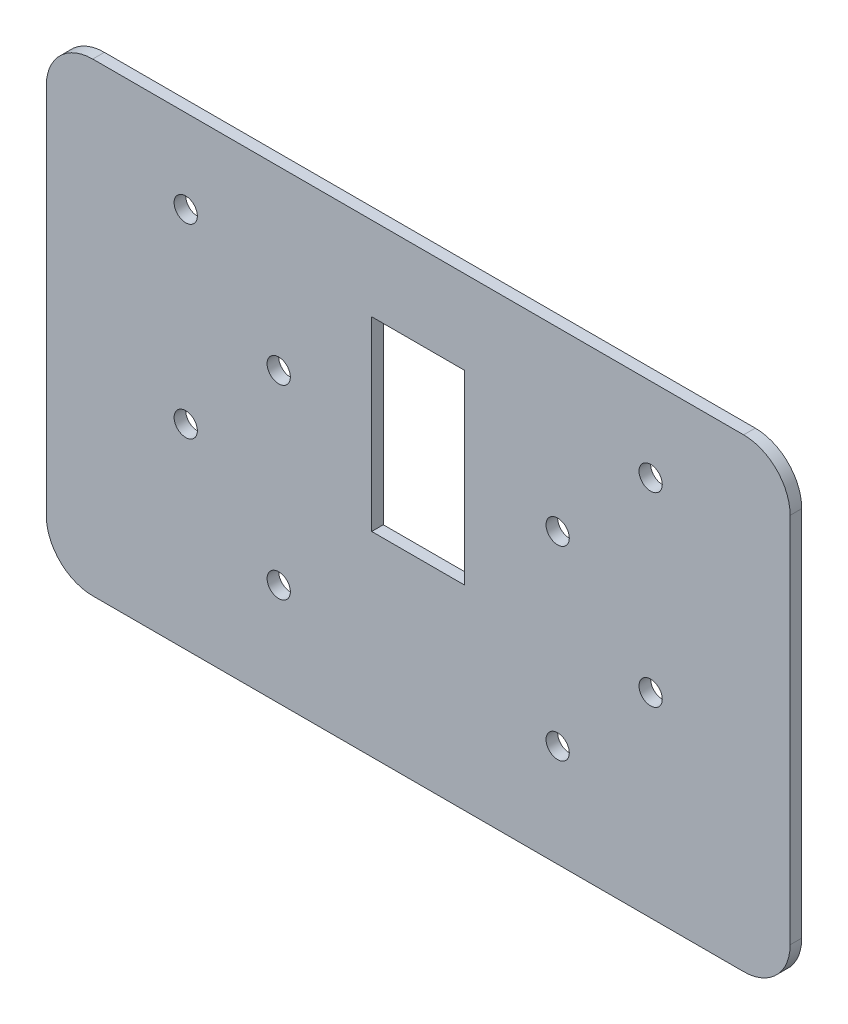
ISO-10303-21;
HEADER;
FILE_DESCRIPTION(('STEP AP214'),'2;1');
FILE_NAME('part.step','',(''),(''),'','','');
FILE_SCHEMA(('AUTOMOTIVE_DESIGN { 1 0 10303 214 1 1 1 1 }'));
ENDSEC;
DATA;
#1=APPLICATION_CONTEXT('core data for automotive mechanical design processes');
#2=APPLICATION_PROTOCOL_DEFINITION('international standard','automotive_design',2000,#1);
#3=PRODUCT_CONTEXT('',#1,'mechanical');
#4=PRODUCT('Part','Part','',(#3));
#5=PRODUCT_RELATED_PRODUCT_CATEGORY('part','',(#4));
#6=PRODUCT_DEFINITION_FORMATION('','',#4);
#7=PRODUCT_DEFINITION_CONTEXT('part definition',#1,'design');
#8=PRODUCT_DEFINITION('design','',#6,#7);
#9=PRODUCT_DEFINITION_SHAPE('','',#8);
#10=(LENGTH_UNIT() NAMED_UNIT(*) SI_UNIT(.MILLI.,.METRE.));
#11=(NAMED_UNIT(*) PLANE_ANGLE_UNIT() SI_UNIT($,.RADIAN.));
#12=(NAMED_UNIT(*) SI_UNIT($,.STERADIAN.) SOLID_ANGLE_UNIT());
#13=UNCERTAINTY_MEASURE_WITH_UNIT(LENGTH_MEASURE(1.E-05),#10,'distance_accuracy_value','');
#14=(GEOMETRIC_REPRESENTATION_CONTEXT(3) GLOBAL_UNCERTAINTY_ASSIGNED_CONTEXT((#13)) GLOBAL_UNIT_ASSIGNED_CONTEXT((#10,
#11,#12)) REPRESENTATION_CONTEXT('',''));
#15=CARTESIAN_POINT('',(0.,0.,0.));
#16=DIRECTION('',(0.,0.,1.));
#17=DIRECTION('',(1.,0.,0.));
#18=AXIS2_PLACEMENT_3D('',#15,#16,#17);
#19=CARTESIAN_POINT('',(0.,454.630831077748,3.175));
#20=DIRECTION('',(0.,1.,0.));
#21=DIRECTION('',(0.,0.,1.));
#22=AXIS2_PLACEMENT_3D('',#19,#20,#21);
#23=PLANE('',#22);
#24=DIRECTION('',(1.,0.,0.));
#25=VECTOR('',#24,1.);
#26=CARTESIAN_POINT('',(0.,454.630831077748,0.));
#27=LINE('',#26,#25);
#28=CARTESIAN_POINT('',(214.219369125784,454.630831077748,0.));
#29=VERTEX_POINT('',#28);
#30=CARTESIAN_POINT('',(392.019369125783,454.630831077748,0.));
#31=VERTEX_POINT('',#30);
#32=EDGE_CURVE('E197',#29,#31,#27,.T.);
#33=ORIENTED_EDGE('',*,*,#32,.F.);
#34=DIRECTION('',(0.,0.,-1.));
#35=VECTOR('',#34,1.);
#36=CARTESIAN_POINT('',(214.219369125784,454.630831077748,3.175));
#37=LINE('',#36,#35);
#38=CARTESIAN_POINT('',(214.219369125784,454.630831077748,3.175));
#39=VERTEX_POINT('',#38);
#40=EDGE_CURVE('E11',#39,#29,#37,.T.);
#41=ORIENTED_EDGE('',*,*,#40,.F.);
#42=DIRECTION('',(1.,0.,0.));
#43=VECTOR('',#42,1.);
#44=CARTESIAN_POINT('',(0.,454.630831077748,3.175));
#45=LINE('',#44,#43);
#46=CARTESIAN_POINT('',(392.019369125783,454.630831077748,3.175));
#47=VERTEX_POINT('',#46);
#48=EDGE_CURVE('E283',#39,#47,#45,.T.);
#49=ORIENTED_EDGE('',*,*,#48,.T.);
#50=DIRECTION('',(0.,0.,-1.));
#51=VECTOR('',#50,1.);
#52=CARTESIAN_POINT('',(392.019369125783,454.630831077748,3.175));
#53=LINE('',#52,#51);
#54=EDGE_CURVE('E55',#47,#31,#53,.T.);
#55=ORIENTED_EDGE('',*,*,#54,.T.);
#56=EDGE_LOOP('',(#33,#41,#49,#55));
#57=FACE_BOUND('',#56,.T.);
#58=ADVANCED_FACE('F36',(#57),#23,.T.);
#59=CARTESIAN_POINT('',(214.219369125784,441.930831077748,3.175));
#60=DIRECTION('',(0.,0.,-1.));
#61=DIRECTION('',(-1.,0.,0.));
#62=AXIS2_PLACEMENT_3D('',#59,#60,#61);
#63=CYLINDRICAL_SURFACE('',#62,12.7);
#64=CARTESIAN_POINT('',(214.219369125784,441.930831077748,0.));
#65=DIRECTION('',(0.,0.,1.));
#66=DIRECTION('',(1.,0.,0.));
#67=AXIS2_PLACEMENT_3D('',#64,#65,#66);
#68=CIRCLE('',#67,12.7);
#69=CARTESIAN_POINT('',(201.519369125784,441.930831077748,0.));
#70=VERTEX_POINT('',#69);
#71=EDGE_CURVE('E199',#29,#70,#68,.T.);
#72=ORIENTED_EDGE('',*,*,#71,.T.);
#73=DIRECTION('',(0.,0.,-1.));
#74=VECTOR('',#73,1.);
#75=CARTESIAN_POINT('',(201.519369125784,441.930831077748,3.175));
#76=LINE('',#75,#74);
#77=CARTESIAN_POINT('',(201.519369125784,441.930831077748,3.175));
#78=VERTEX_POINT('',#77);
#79=EDGE_CURVE('E46',#78,#70,#76,.T.);
#80=ORIENTED_EDGE('',*,*,#79,.F.);
#81=CARTESIAN_POINT('',(214.219369125784,441.930831077748,3.175));
#82=DIRECTION('',(0.,0.,1.));
#83=DIRECTION('',(1.,0.,0.));
#84=AXIS2_PLACEMENT_3D('',#81,#82,#83);
#85=CIRCLE('',#84,12.7);
#86=EDGE_CURVE('E285',#39,#78,#85,.T.);
#87=ORIENTED_EDGE('',*,*,#86,.F.);
#88=ORIENTED_EDGE('',*,*,#40,.T.);
#89=EDGE_LOOP('',(#72,#80,#87,#88));
#90=FACE_BOUND('',#89,.T.);
#91=ADVANCED_FACE('F318',(#90),#63,.T.);
#92=CARTESIAN_POINT('',(201.519369125784,0.,3.175));
#93=DIRECTION('',(1.,0.,0.));
#94=DIRECTION('',(0.,1.,0.));
#95=AXIS2_PLACEMENT_3D('',#92,#93,#94);
#96=PLANE('',#95);
#97=DIRECTION('',(0.,-1.,0.));
#98=VECTOR('',#97,1.);
#99=CARTESIAN_POINT('',(201.519369125784,0.,0.));
#100=LINE('',#99,#98);
#101=CARTESIAN_POINT('',(201.519369125784,340.330831077748,0.));
#102=VERTEX_POINT('',#101);
#103=EDGE_CURVE('E202',#70,#102,#100,.T.);
#104=ORIENTED_EDGE('',*,*,#103,.T.);
#105=DIRECTION('',(0.,0.,-1.));
#106=VECTOR('',#105,1.);
#107=CARTESIAN_POINT('',(201.519369125784,340.330831077748,3.175));
#108=LINE('',#107,#106);
#109=CARTESIAN_POINT('',(201.519369125784,340.330831077748,3.175));
#110=VERTEX_POINT('',#109);
#111=EDGE_CURVE('E236',#110,#102,#108,.T.);
#112=ORIENTED_EDGE('',*,*,#111,.F.);
#113=DIRECTION('',(0.,-1.,0.));
#114=VECTOR('',#113,1.);
#115=CARTESIAN_POINT('',(201.519369125784,0.,3.175));
#116=LINE('',#115,#114);
#117=EDGE_CURVE('E288',#78,#110,#116,.T.);
#118=ORIENTED_EDGE('',*,*,#117,.F.);
#119=ORIENTED_EDGE('',*,*,#79,.T.);
#120=EDGE_LOOP('',(#104,#112,#118,#119));
#121=FACE_BOUND('',#120,.T.);
#122=ADVANCED_FACE('F323',(#121),#96,.F.);
#123=CARTESIAN_POINT('',(214.219369125784,340.330831077748,3.175));
#124=DIRECTION('',(0.,0.,-1.));
#125=DIRECTION('',(-1.,0.,0.));
#126=AXIS2_PLACEMENT_3D('',#123,#124,#125);
#127=CYLINDRICAL_SURFACE('',#126,12.7);
#128=CARTESIAN_POINT('',(214.219369125784,340.330831077748,0.));
#129=DIRECTION('',(0.,0.,1.));
#130=DIRECTION('',(1.,0.,0.));
#131=AXIS2_PLACEMENT_3D('',#128,#129,#130);
#132=CIRCLE('',#131,12.7);
#133=CARTESIAN_POINT('',(214.219369125784,327.630831077748,0.));
#134=VERTEX_POINT('',#133);
#135=EDGE_CURVE('E205',#102,#134,#132,.T.);
#136=ORIENTED_EDGE('',*,*,#135,.T.);
#137=DIRECTION('',(0.,0.,-1.));
#138=VECTOR('',#137,1.);
#139=CARTESIAN_POINT('',(214.219369125784,327.630831077748,3.175));
#140=LINE('',#139,#138);
#141=CARTESIAN_POINT('',(214.219369125784,327.630831077748,3.175));
#142=VERTEX_POINT('',#141);
#143=EDGE_CURVE('E233',#142,#134,#140,.T.);
#144=ORIENTED_EDGE('',*,*,#143,.F.);
#145=CARTESIAN_POINT('',(214.219369125784,340.330831077748,3.175));
#146=DIRECTION('',(0.,0.,1.));
#147=DIRECTION('',(1.,0.,0.));
#148=AXIS2_PLACEMENT_3D('',#145,#146,#147);
#149=CIRCLE('',#148,12.7);
#150=EDGE_CURVE('E291',#110,#142,#149,.T.);
#151=ORIENTED_EDGE('',*,*,#150,.F.);
#152=ORIENTED_EDGE('',*,*,#111,.T.);
#153=EDGE_LOOP('',(#136,#144,#151,#152));
#154=FACE_BOUND('',#153,.T.);
#155=ADVANCED_FACE('F295',(#154),#127,.T.);
#156=CARTESIAN_POINT('',(0.,327.630831077748,3.175));
#157=DIRECTION('',(0.,1.,0.));
#158=DIRECTION('',(0.,0.,1.));
#159=AXIS2_PLACEMENT_3D('',#156,#157,#158);
#160=PLANE('',#159);
#161=DIRECTION('',(1.,0.,0.));
#162=VECTOR('',#161,1.);
#163=CARTESIAN_POINT('',(0.,327.630831077748,0.));
#164=LINE('',#163,#162);
#165=CARTESIAN_POINT('',(392.019369125783,327.630831077748,0.));
#166=VERTEX_POINT('',#165);
#167=EDGE_CURVE('E208',#134,#166,#164,.T.);
#168=ORIENTED_EDGE('',*,*,#167,.T.);
#169=DIRECTION('',(0.,0.,-1.));
#170=VECTOR('',#169,1.);
#171=CARTESIAN_POINT('',(392.019369125783,327.630831077748,3.175));
#172=LINE('',#171,#170);
#173=CARTESIAN_POINT('',(392.019369125783,327.630831077748,3.175));
#174=VERTEX_POINT('',#173);
#175=EDGE_CURVE('E152',#174,#166,#172,.T.);
#176=ORIENTED_EDGE('',*,*,#175,.F.);
#177=DIRECTION('',(1.,0.,0.));
#178=VECTOR('',#177,1.);
#179=CARTESIAN_POINT('',(0.,327.630831077748,3.175));
#180=LINE('',#179,#178);
#181=EDGE_CURVE('E141',#142,#174,#180,.T.);
#182=ORIENTED_EDGE('',*,*,#181,.F.);
#183=ORIENTED_EDGE('',*,*,#143,.T.);
#184=EDGE_LOOP('',(#168,#176,#182,#183));
#185=FACE_BOUND('',#184,.T.);
#186=ADVANCED_FACE('F297',(#185),#160,.F.);
#187=CARTESIAN_POINT('',(392.019369125784,340.330831077748,3.175));
#188=DIRECTION('',(0.,0.,-1.));
#189=DIRECTION('',(-1.,0.,0.));
#190=AXIS2_PLACEMENT_3D('',#187,#188,#189);
#191=CYLINDRICAL_SURFACE('',#190,12.7);
#192=CARTESIAN_POINT('',(392.019369125784,340.330831077748,0.));
#193=DIRECTION('',(0.,0.,1.));
#194=DIRECTION('',(1.,0.,0.));
#195=AXIS2_PLACEMENT_3D('',#192,#193,#194);
#196=CIRCLE('',#195,12.7);
#197=CARTESIAN_POINT('',(404.719369125784,340.330831077748,0.));
#198=VERTEX_POINT('',#197);
#199=EDGE_CURVE('E149',#166,#198,#196,.T.);
#200=ORIENTED_EDGE('',*,*,#199,.T.);
#201=DIRECTION('',(0.,0.,-1.));
#202=VECTOR('',#201,1.);
#203=CARTESIAN_POINT('',(404.719369125784,340.330831077748,3.175));
#204=LINE('',#203,#202);
#205=CARTESIAN_POINT('',(404.719369125784,340.330831077748,3.175));
#206=VERTEX_POINT('',#205);
#207=EDGE_CURVE('E147',#206,#198,#204,.T.);
#208=ORIENTED_EDGE('',*,*,#207,.F.);
#209=CARTESIAN_POINT('',(392.019369125784,340.330831077748,3.175));
#210=DIRECTION('',(0.,0.,1.));
#211=DIRECTION('',(1.,0.,0.));
#212=AXIS2_PLACEMENT_3D('',#209,#210,#211);
#213=CIRCLE('',#212,12.7);
#214=EDGE_CURVE('E132',#174,#206,#213,.T.);
#215=ORIENTED_EDGE('',*,*,#214,.F.);
#216=ORIENTED_EDGE('',*,*,#175,.T.);
#217=EDGE_LOOP('',(#200,#208,#215,#216));
#218=FACE_BOUND('',#217,.T.);
#219=ADVANCED_FACE('F148',(#218),#191,.T.);
#220=CARTESIAN_POINT('',(404.719369125784,0.,3.175));
#221=DIRECTION('',(1.,0.,0.));
#222=DIRECTION('',(0.,0.,-1.));
#223=AXIS2_PLACEMENT_3D('',#220,#221,#222);
#224=PLANE('',#223);
#225=DIRECTION('',(0.,-1.,0.));
#226=VECTOR('',#225,1.);
#227=CARTESIAN_POINT('',(404.719369125784,0.,0.));
#228=LINE('',#227,#226);
#229=CARTESIAN_POINT('',(404.719369125784,441.930831077748,0.));
#230=VERTEX_POINT('',#229);
#231=EDGE_CURVE('E212',#230,#198,#228,.T.);
#232=ORIENTED_EDGE('',*,*,#231,.F.);
#233=DIRECTION('',(0.,0.,-1.));
#234=VECTOR('',#233,1.);
#235=CARTESIAN_POINT('',(404.719369125784,441.930831077748,3.175));
#236=LINE('',#235,#234);
#237=CARTESIAN_POINT('',(404.719369125784,441.930831077748,3.175));
#238=VERTEX_POINT('',#237);
#239=EDGE_CURVE('E92',#238,#230,#236,.T.);
#240=ORIENTED_EDGE('',*,*,#239,.F.);
#241=DIRECTION('',(0.,-1.,0.));
#242=VECTOR('',#241,1.);
#243=CARTESIAN_POINT('',(404.719369125784,0.,3.175));
#244=LINE('',#243,#242);
#245=EDGE_CURVE('E139',#238,#206,#244,.T.);
#246=ORIENTED_EDGE('',*,*,#245,.T.);
#247=ORIENTED_EDGE('',*,*,#207,.T.);
#248=EDGE_LOOP('',(#232,#240,#246,#247));
#249=FACE_BOUND('',#248,.T.);
#250=ADVANCED_FACE('F154',(#249),#224,.T.);
#251=CARTESIAN_POINT('',(290.419369125784,0.,3.175));
#252=DIRECTION('',(1.,0.,0.));
#253=DIRECTION('',(0.,0.,-1.));
#254=AXIS2_PLACEMENT_3D('',#251,#252,#253);
#255=PLANE('',#254);
#256=DIRECTION('',(0.,-1.,0.));
#257=VECTOR('',#256,1.);
#258=CARTESIAN_POINT('',(290.419369125784,0.,0.));
#259=LINE('',#258,#257);
#260=CARTESIAN_POINT('',(290.419369125784,431.770831077748,0.));
#261=VERTEX_POINT('',#260);
#262=CARTESIAN_POINT('',(290.419369125784,380.970831077748,0.));
#263=VERTEX_POINT('',#262);
#264=EDGE_CURVE('E173',#261,#263,#259,.T.);
#265=ORIENTED_EDGE('',*,*,#264,.F.);
#266=DIRECTION('',(0.,0.,-1.));
#267=VECTOR('',#266,1.);
#268=CARTESIAN_POINT('',(290.419369125784,431.770831077748,3.175));
#269=LINE('',#268,#267);
#270=CARTESIAN_POINT('',(290.419369125784,431.770831077748,3.175));
#271=VERTEX_POINT('',#270);
#272=EDGE_CURVE('E40',#271,#261,#269,.T.);
#273=ORIENTED_EDGE('',*,*,#272,.F.);
#274=DIRECTION('',(0.,-1.,0.));
#275=VECTOR('',#274,1.);
#276=CARTESIAN_POINT('',(290.419369125784,0.,3.175));
#277=LINE('',#276,#275);
#278=CARTESIAN_POINT('',(290.419369125784,380.970831077748,3.175));
#279=VERTEX_POINT('',#278);
#280=EDGE_CURVE('E229',#271,#279,#277,.T.);
#281=ORIENTED_EDGE('',*,*,#280,.T.);
#282=DIRECTION('',(0.,0.,-1.));
#283=VECTOR('',#282,1.);
#284=CARTESIAN_POINT('',(290.419369125784,380.970831077748,3.175));
#285=LINE('',#284,#283);
#286=EDGE_CURVE('E172',#279,#263,#285,.T.);
#287=ORIENTED_EDGE('',*,*,#286,.T.);
#288=EDGE_LOOP('',(#265,#273,#281,#287));
#289=FACE_BOUND('',#288,.T.);
#290=ADVANCED_FACE('F38',(#289),#255,.T.);
#291=CARTESIAN_POINT('',(0.,431.770831077748,3.175));
#292=DIRECTION('',(0.,-1.,0.));
#293=DIRECTION('',(0.,0.,-1.));
#294=AXIS2_PLACEMENT_3D('',#291,#292,#293);
#295=PLANE('',#294);
#296=DIRECTION('',(-1.,0.,0.));
#297=VECTOR('',#296,1.);
#298=CARTESIAN_POINT('',(0.,431.770831077748,0.));
#299=LINE('',#298,#297);
#300=CARTESIAN_POINT('',(315.819369125784,431.770831077748,0.));
#301=VERTEX_POINT('',#300);
#302=EDGE_CURVE('E176',#301,#261,#299,.T.);
#303=ORIENTED_EDGE('',*,*,#302,.F.);
#304=DIRECTION('',(0.,0.,-1.));
#305=VECTOR('',#304,1.);
#306=CARTESIAN_POINT('',(315.819369125784,431.770831077748,3.175));
#307=LINE('',#306,#305);
#308=CARTESIAN_POINT('',(315.819369125784,431.770831077748,3.175));
#309=VERTEX_POINT('',#308);
#310=EDGE_CURVE('E243',#309,#301,#307,.T.);
#311=ORIENTED_EDGE('',*,*,#310,.F.);
#312=DIRECTION('',(-1.,0.,0.));
#313=VECTOR('',#312,1.);
#314=CARTESIAN_POINT('',(0.,431.770831077748,3.175));
#315=LINE('',#314,#313);
#316=EDGE_CURVE('E252',#309,#271,#315,.T.);
#317=ORIENTED_EDGE('',*,*,#316,.T.);
#318=ORIENTED_EDGE('',*,*,#272,.T.);
#319=EDGE_LOOP('',(#303,#311,#317,#318));
#320=FACE_BOUND('',#319,.T.);
#321=ADVANCED_FACE('F250',(#320),#295,.T.);
#322=CARTESIAN_POINT('',(315.819369125784,0.,3.175));
#323=DIRECTION('',(-1.,0.,0.));
#324=DIRECTION('',(0.,0.,1.));
#325=AXIS2_PLACEMENT_3D('',#322,#323,#324);
#326=PLANE('',#325);
#327=DIRECTION('',(0.,1.,0.));
#328=VECTOR('',#327,1.);
#329=CARTESIAN_POINT('',(315.819369125784,0.,0.));
#330=LINE('',#329,#328);
#331=CARTESIAN_POINT('',(315.819369125784,380.970831077748,0.));
#332=VERTEX_POINT('',#331);
#333=EDGE_CURVE('E179',#332,#301,#330,.T.);
#334=ORIENTED_EDGE('',*,*,#333,.F.);
#335=DIRECTION('',(0.,0.,-1.));
#336=VECTOR('',#335,1.);
#337=CARTESIAN_POINT('',(315.819369125784,380.970831077748,3.175));
#338=LINE('',#337,#336);
#339=CARTESIAN_POINT('',(315.819369125784,380.970831077748,3.175));
#340=VERTEX_POINT('',#339);
#341=EDGE_CURVE('E242',#340,#332,#338,.T.);
#342=ORIENTED_EDGE('',*,*,#341,.F.);
#343=DIRECTION('',(0.,1.,0.));
#344=VECTOR('',#343,1.);
#345=CARTESIAN_POINT('',(315.819369125784,0.,3.175));
#346=LINE('',#345,#344);
#347=EDGE_CURVE('E259',#340,#309,#346,.T.);
#348=ORIENTED_EDGE('',*,*,#347,.T.);
#349=ORIENTED_EDGE('',*,*,#310,.T.);
#350=EDGE_LOOP('',(#334,#342,#348,#349));
#351=FACE_BOUND('',#350,.T.);
#352=ADVANCED_FACE('F257',(#351),#326,.T.);
#353=CARTESIAN_POINT('',(239.619369125784,431.770831077748,3.175));
#354=DIRECTION('',(0.,0.,-1.));
#355=DIRECTION('',(-1.,0.,0.));
#356=AXIS2_PLACEMENT_3D('',#353,#354,#355);
#357=CYLINDRICAL_SURFACE('',#356,3.17499999999997);
#358=CARTESIAN_POINT('',(239.619369125784,431.770831077748,3.175));
#359=DIRECTION('',(0.,0.,1.));
#360=DIRECTION('',(1.,0.,0.));
#361=AXIS2_PLACEMENT_3D('',#358,#359,#360);
#362=CIRCLE('',#361,3.17499999999997);
#363=CARTESIAN_POINT('',(242.794369125784,431.770831077748,3.175));
#364=VERTEX_POINT('',#363);
#365=EDGE_CURVE('E166',#364,#364,#362,.T.);
#366=ORIENTED_EDGE('',*,*,#365,.T.);
#367=EDGE_LOOP('',(#366));
#368=FACE_BOUND('',#367,.T.);
#369=CARTESIAN_POINT('',(239.619369125784,431.770831077748,0.));
#370=DIRECTION('',(0.,0.,1.));
#371=DIRECTION('',(1.,0.,0.));
#372=AXIS2_PLACEMENT_3D('',#369,#370,#371);
#373=CIRCLE('',#372,3.17499999999997);
#374=CARTESIAN_POINT('',(242.794369125784,431.770831077748,0.));
#375=VERTEX_POINT('',#374);
#376=EDGE_CURVE('E223',#375,#375,#373,.T.);
#377=ORIENTED_EDGE('',*,*,#376,.F.);
#378=EDGE_LOOP('',(#377));
#379=FACE_BOUND('',#378,.T.);
#380=ADVANCED_FACE('F343',(#368,#379),#357,.F.);
#381=CARTESIAN_POINT('',(239.619369125784,380.970831077748,3.175));
#382=DIRECTION('',(0.,0.,-1.));
#383=DIRECTION('',(-1.,0.,0.));
#384=AXIS2_PLACEMENT_3D('',#381,#382,#383);
#385=CYLINDRICAL_SURFACE('',#384,3.17499999999997);
#386=CARTESIAN_POINT('',(239.619369125784,380.970831077748,3.175));
#387=DIRECTION('',(0.,0.,1.));
#388=DIRECTION('',(1.,0.,0.));
#389=AXIS2_PLACEMENT_3D('',#386,#387,#388);
#390=CIRCLE('',#389,3.17499999999997);
#391=CARTESIAN_POINT('',(242.794369125784,380.970831077748,3.175));
#392=VERTEX_POINT('',#391);
#393=EDGE_CURVE('E163',#392,#392,#390,.T.);
#394=ORIENTED_EDGE('',*,*,#393,.T.);
#395=EDGE_LOOP('',(#394));
#396=FACE_BOUND('',#395,.T.);
#397=CARTESIAN_POINT('',(239.619369125784,380.970831077748,0.));
#398=DIRECTION('',(0.,0.,1.));
#399=DIRECTION('',(1.,0.,0.));
#400=AXIS2_PLACEMENT_3D('',#397,#398,#399);
#401=CIRCLE('',#400,3.17499999999997);
#402=CARTESIAN_POINT('',(242.794369125784,380.970831077748,0.));
#403=VERTEX_POINT('',#402);
#404=EDGE_CURVE('E220',#403,#403,#401,.T.);
#405=ORIENTED_EDGE('',*,*,#404,.F.);
#406=EDGE_LOOP('',(#405));
#407=FACE_BOUND('',#406,.T.);
#408=ADVANCED_FACE('F313',(#396,#407),#385,.F.);
#409=CARTESIAN_POINT('',(265.019369125761,355.570831077745,3.175));
#410=DIRECTION('',(0.,0.,-1.));
#411=DIRECTION('',(-1.,0.,0.));
#412=AXIS2_PLACEMENT_3D('',#409,#410,#411);
#413=CYLINDRICAL_SURFACE('',#412,3.17500000000002);
#414=CARTESIAN_POINT('',(265.019369125761,355.570831077745,3.175));
#415=DIRECTION('',(0.,0.,1.));
#416=DIRECTION('',(1.,0.,0.));
#417=AXIS2_PLACEMENT_3D('',#414,#415,#416);
#418=CIRCLE('',#417,3.17500000000002);
#419=CARTESIAN_POINT('',(268.194369125761,355.570831077745,3.175));
#420=VERTEX_POINT('',#419);
#421=EDGE_CURVE('E157',#420,#420,#418,.T.);
#422=ORIENTED_EDGE('',*,*,#421,.T.);
#423=EDGE_LOOP('',(#422));
#424=FACE_BOUND('',#423,.T.);
#425=CARTESIAN_POINT('',(265.019369125761,355.570831077745,0.));
#426=DIRECTION('',(0.,0.,1.));
#427=DIRECTION('',(1.,0.,0.));
#428=AXIS2_PLACEMENT_3D('',#425,#426,#427);
#429=CIRCLE('',#428,3.17500000000002);
#430=CARTESIAN_POINT('',(268.194369125761,355.570831077745,0.));
#431=VERTEX_POINT('',#430);
#432=EDGE_CURVE('E217',#431,#431,#429,.T.);
#433=ORIENTED_EDGE('',*,*,#432,.F.);
#434=EDGE_LOOP('',(#433));
#435=FACE_BOUND('',#434,.T.);
#436=ADVANCED_FACE('F304',(#424,#435),#413,.F.);
#437=CARTESIAN_POINT('',(392.019369125784,441.930831077748,3.175));
#438=DIRECTION('',(0.,0.,-1.));
#439=DIRECTION('',(-1.,0.,0.));
#440=AXIS2_PLACEMENT_3D('',#437,#438,#439);
#441=CYLINDRICAL_SURFACE('',#440,12.7);
#442=CARTESIAN_POINT('',(392.019369125784,441.930831077748,0.));
#443=DIRECTION('',(0.,0.,1.));
#444=DIRECTION('',(1.,0.,0.));
#445=AXIS2_PLACEMENT_3D('',#442,#443,#444);
#446=CIRCLE('',#445,12.7);
#447=EDGE_CURVE('E214',#31,#230,#446,.F.);
#448=ORIENTED_EDGE('',*,*,#447,.F.);
#449=ORIENTED_EDGE('',*,*,#54,.F.);
#450=CARTESIAN_POINT('',(392.019369125784,441.930831077748,3.175));
#451=DIRECTION('',(0.,0.,1.));
#452=DIRECTION('',(1.,0.,0.));
#453=AXIS2_PLACEMENT_3D('',#450,#451,#452);
#454=CIRCLE('',#453,12.7);
#455=EDGE_CURVE('E155',#47,#238,#454,.F.);
#456=ORIENTED_EDGE('',*,*,#455,.T.);
#457=ORIENTED_EDGE('',*,*,#239,.T.);
#458=EDGE_LOOP('',(#448,#449,#456,#457));
#459=FACE_BOUND('',#458,.T.);
#460=ADVANCED_FACE('F301',(#459),#441,.T.);
#461=CARTESIAN_POINT('',(341.21936912576,355.570831077744,3.175));
#462=DIRECTION('',(0.,0.,-1.));
#463=DIRECTION('',(-1.,0.,0.));
#464=AXIS2_PLACEMENT_3D('',#461,#462,#463);
#465=CYLINDRICAL_SURFACE('',#464,3.17500000000002);
#466=CARTESIAN_POINT('',(341.21936912576,355.570831077744,3.175));
#467=DIRECTION('',(0.,0.,1.));
#468=DIRECTION('',(1.,0.,0.));
#469=AXIS2_PLACEMENT_3D('',#466,#467,#468);
#470=CIRCLE('',#469,3.17500000000002);
#471=CARTESIAN_POINT('',(344.39436912576,355.570831077744,3.175));
#472=VERTEX_POINT('',#471);
#473=EDGE_CURVE('E280',#472,#472,#470,.T.);
#474=ORIENTED_EDGE('',*,*,#473,.T.);
#475=EDGE_LOOP('',(#474));
#476=FACE_BOUND('',#475,.T.);
#477=CARTESIAN_POINT('',(341.21936912576,355.570831077744,0.));
#478=DIRECTION('',(0.,0.,1.));
#479=DIRECTION('',(1.,0.,0.));
#480=AXIS2_PLACEMENT_3D('',#477,#478,#479);
#481=CIRCLE('',#480,3.17500000000002);
#482=CARTESIAN_POINT('',(344.39436912576,355.570831077744,0.));
#483=VERTEX_POINT('',#482);
#484=EDGE_CURVE('E194',#483,#483,#481,.T.);
#485=ORIENTED_EDGE('',*,*,#484,.F.);
#486=EDGE_LOOP('',(#485));
#487=FACE_BOUND('',#486,.T.);
#488=ADVANCED_FACE('F303',(#476,#487),#465,.F.);
#489=CARTESIAN_POINT('',(366.619369125784,431.770831077748,3.175));
#490=DIRECTION('',(0.,0.,-1.));
#491=DIRECTION('',(-1.,0.,0.));
#492=AXIS2_PLACEMENT_3D('',#489,#490,#491);
#493=CYLINDRICAL_SURFACE('',#492,3.17499999999997);
#494=CARTESIAN_POINT('',(366.619369125784,431.770831077748,3.175));
#495=DIRECTION('',(0.,0.,1.));
#496=DIRECTION('',(1.,0.,0.));
#497=AXIS2_PLACEMENT_3D('',#494,#495,#496);
#498=CIRCLE('',#497,3.17499999999997);
#499=CARTESIAN_POINT('',(369.794369125784,431.770831077748,3.175));
#500=VERTEX_POINT('',#499);
#501=EDGE_CURVE('E277',#500,#500,#498,.T.);
#502=ORIENTED_EDGE('',*,*,#501,.T.);
#503=EDGE_LOOP('',(#502));
#504=FACE_BOUND('',#503,.T.);
#505=CARTESIAN_POINT('',(366.619369125784,431.770831077748,0.));
#506=DIRECTION('',(0.,0.,1.));
#507=DIRECTION('',(1.,0.,0.));
#508=AXIS2_PLACEMENT_3D('',#505,#506,#507);
#509=CIRCLE('',#508,3.17499999999997);
#510=CARTESIAN_POINT('',(369.794369125784,431.770831077748,0.));
#511=VERTEX_POINT('',#510);
#512=EDGE_CURVE('E191',#511,#511,#509,.T.);
#513=ORIENTED_EDGE('',*,*,#512,.F.);
#514=EDGE_LOOP('',(#513));
#515=FACE_BOUND('',#514,.T.);
#516=ADVANCED_FACE('F310',(#504,#515),#493,.F.);
#517=CARTESIAN_POINT('',(341.219369125784,406.370831077748,3.175));
#518=DIRECTION('',(0.,0.,-1.));
#519=DIRECTION('',(-1.,0.,0.));
#520=AXIS2_PLACEMENT_3D('',#517,#518,#519);
#521=CYLINDRICAL_SURFACE('',#520,3.17499999999997);
#522=CARTESIAN_POINT('',(341.219369125784,406.370831077748,3.175));
#523=DIRECTION('',(0.,0.,1.));
#524=DIRECTION('',(1.,0.,0.));
#525=AXIS2_PLACEMENT_3D('',#522,#523,#524);
#526=CIRCLE('',#525,3.17499999999997);
#527=CARTESIAN_POINT('',(344.394369125784,406.370831077748,3.175));
#528=VERTEX_POINT('',#527);
#529=EDGE_CURVE('E271',#528,#528,#526,.T.);
#530=ORIENTED_EDGE('',*,*,#529,.T.);
#531=EDGE_LOOP('',(#530));
#532=FACE_BOUND('',#531,.T.);
#533=CARTESIAN_POINT('',(341.219369125784,406.370831077748,0.));
#534=DIRECTION('',(0.,0.,1.));
#535=DIRECTION('',(1.,0.,0.));
#536=AXIS2_PLACEMENT_3D('',#533,#534,#535);
#537=CIRCLE('',#536,3.17499999999997);
#538=CARTESIAN_POINT('',(344.394369125784,406.370831077748,0.));
#539=VERTEX_POINT('',#538);
#540=EDGE_CURVE('E188',#539,#539,#537,.T.);
#541=ORIENTED_EDGE('',*,*,#540,.F.);
#542=EDGE_LOOP('',(#541));
#543=FACE_BOUND('',#542,.T.);
#544=ADVANCED_FACE('F330',(#532,#543),#521,.F.);
#545=CARTESIAN_POINT('',(366.619369125784,380.970831077748,3.175));
#546=DIRECTION('',(0.,0.,-1.));
#547=DIRECTION('',(-1.,0.,0.));
#548=AXIS2_PLACEMENT_3D('',#545,#546,#547);
#549=CYLINDRICAL_SURFACE('',#548,3.17499999999997);
#550=CARTESIAN_POINT('',(366.619369125784,380.970831077748,3.175));
#551=DIRECTION('',(0.,0.,1.));
#552=DIRECTION('',(1.,0.,0.));
#553=AXIS2_PLACEMENT_3D('',#550,#551,#552);
#554=CIRCLE('',#553,3.17499999999997);
#555=CARTESIAN_POINT('',(369.794369125784,380.970831077748,3.175));
#556=VERTEX_POINT('',#555);
#557=EDGE_CURVE('E268',#556,#556,#554,.T.);
#558=ORIENTED_EDGE('',*,*,#557,.T.);
#559=EDGE_LOOP('',(#558));
#560=FACE_BOUND('',#559,.T.);
#561=CARTESIAN_POINT('',(366.619369125784,380.970831077748,0.));
#562=DIRECTION('',(0.,0.,1.));
#563=DIRECTION('',(1.,0.,0.));
#564=AXIS2_PLACEMENT_3D('',#561,#562,#563);
#565=CIRCLE('',#564,3.17499999999997);
#566=CARTESIAN_POINT('',(369.794369125784,380.970831077748,0.));
#567=VERTEX_POINT('',#566);
#568=EDGE_CURVE('E185',#567,#567,#565,.T.);
#569=ORIENTED_EDGE('',*,*,#568,.F.);
#570=EDGE_LOOP('',(#569));
#571=FACE_BOUND('',#570,.T.);
#572=ADVANCED_FACE('F334',(#560,#571),#549,.F.);
#573=CARTESIAN_POINT('',(0.,380.970831077748,3.175));
#574=DIRECTION('',(0.,1.,0.));
#575=DIRECTION('',(0.,0.,1.));
#576=AXIS2_PLACEMENT_3D('',#573,#574,#575);
#577=PLANE('',#576);
#578=DIRECTION('',(1.,0.,0.));
#579=VECTOR('',#578,1.);
#580=CARTESIAN_POINT('',(0.,380.970831077748,0.));
#581=LINE('',#580,#579);
#582=EDGE_CURVE('E182',#263,#332,#581,.T.);
#583=ORIENTED_EDGE('',*,*,#582,.F.);
#584=ORIENTED_EDGE('',*,*,#286,.F.);
#585=DIRECTION('',(1.,0.,0.));
#586=VECTOR('',#585,1.);
#587=CARTESIAN_POINT('',(0.,380.970831077748,3.175));
#588=LINE('',#587,#586);
#589=EDGE_CURVE('E265',#279,#340,#588,.T.);
#590=ORIENTED_EDGE('',*,*,#589,.T.);
#591=ORIENTED_EDGE('',*,*,#341,.T.);
#592=EDGE_LOOP('',(#583,#584,#590,#591));
#593=FACE_BOUND('',#592,.T.);
#594=ADVANCED_FACE('F267',(#593),#577,.T.);
#595=CARTESIAN_POINT('',(265.019369125783,406.370831077748,3.175));
#596=DIRECTION('',(0.,0.,-1.));
#597=DIRECTION('',(-1.,0.,0.));
#598=AXIS2_PLACEMENT_3D('',#595,#596,#597);
#599=CYLINDRICAL_SURFACE('',#598,3.17499999999997);
#600=CARTESIAN_POINT('',(265.019369125783,406.370831077748,3.175));
#601=DIRECTION('',(0.,0.,1.));
#602=DIRECTION('',(1.,0.,0.));
#603=AXIS2_PLACEMENT_3D('',#600,#601,#602);
#604=CIRCLE('',#603,3.17499999999997);
#605=CARTESIAN_POINT('',(268.194369125784,406.370831077748,3.175));
#606=VERTEX_POINT('',#605);
#607=EDGE_CURVE('E169',#606,#606,#604,.T.);
#608=ORIENTED_EDGE('',*,*,#607,.T.);
#609=EDGE_LOOP('',(#608));
#610=FACE_BOUND('',#609,.T.);
#611=CARTESIAN_POINT('',(265.019369125783,406.370831077748,0.));
#612=DIRECTION('',(0.,0.,1.));
#613=DIRECTION('',(1.,0.,0.));
#614=AXIS2_PLACEMENT_3D('',#611,#612,#613);
#615=CIRCLE('',#614,3.17499999999997);
#616=CARTESIAN_POINT('',(268.194369125784,406.370831077748,0.));
#617=VERTEX_POINT('',#616);
#618=EDGE_CURVE('E226',#617,#617,#615,.T.);
#619=ORIENTED_EDGE('',*,*,#618,.F.);
#620=EDGE_LOOP('',(#619));
#621=FACE_BOUND('',#620,.T.);
#622=ADVANCED_FACE('F341',(#610,#621),#599,.F.);
#623=CARTESIAN_POINT('',(0.,0.,3.175));
#624=DIRECTION('',(0.,0.,1.));
#625=DIRECTION('',(1.,0.,0.));
#626=AXIS2_PLACEMENT_3D('',#623,#624,#625);
#627=PLANE('',#626);
#628=ORIENTED_EDGE('',*,*,#280,.F.);
#629=ORIENTED_EDGE('',*,*,#316,.F.);
#630=ORIENTED_EDGE('',*,*,#347,.F.);
#631=ORIENTED_EDGE('',*,*,#589,.F.);
#632=EDGE_LOOP('',(#628,#629,#630,#631));
#633=FACE_BOUND('',#632,.T.);
#634=ORIENTED_EDGE('',*,*,#557,.F.);
#635=EDGE_LOOP('',(#634));
#636=FACE_BOUND('',#635,.T.);
#637=ORIENTED_EDGE('',*,*,#529,.F.);
#638=EDGE_LOOP('',(#637));
#639=FACE_BOUND('',#638,.T.);
#640=ORIENTED_EDGE('',*,*,#501,.F.);
#641=EDGE_LOOP('',(#640));
#642=FACE_BOUND('',#641,.T.);
#643=ORIENTED_EDGE('',*,*,#473,.F.);
#644=EDGE_LOOP('',(#643));
#645=FACE_BOUND('',#644,.T.);
#646=ORIENTED_EDGE('',*,*,#48,.F.);
#647=ORIENTED_EDGE('',*,*,#86,.T.);
#648=ORIENTED_EDGE('',*,*,#117,.T.);
#649=ORIENTED_EDGE('',*,*,#150,.T.);
#650=ORIENTED_EDGE('',*,*,#181,.T.);
#651=ORIENTED_EDGE('',*,*,#214,.T.);
#652=ORIENTED_EDGE('',*,*,#245,.F.);
#653=ORIENTED_EDGE('',*,*,#455,.F.);
#654=EDGE_LOOP('',(#646,#647,#648,#649,#650,#651,#652,#653));
#655=FACE_BOUND('',#654,.T.);
#656=ORIENTED_EDGE('',*,*,#421,.F.);
#657=EDGE_LOOP('',(#656));
#658=FACE_BOUND('',#657,.T.);
#659=ORIENTED_EDGE('',*,*,#393,.F.);
#660=EDGE_LOOP('',(#659));
#661=FACE_BOUND('',#660,.T.);
#662=ORIENTED_EDGE('',*,*,#365,.F.);
#663=EDGE_LOOP('',(#662));
#664=FACE_BOUND('',#663,.T.);
#665=ORIENTED_EDGE('',*,*,#607,.F.);
#666=EDGE_LOOP('',(#665));
#667=FACE_BOUND('',#666,.T.);
#668=ADVANCED_FACE('F135',(#633,#636,#639,#642,#645,#655,#658,#661,#664,#667),#627,.T.);
#669=CARTESIAN_POINT('',(0.,0.,0.));
#670=DIRECTION('',(0.,0.,1.));
#671=DIRECTION('',(1.,0.,0.));
#672=AXIS2_PLACEMENT_3D('',#669,#670,#671);
#673=PLANE('',#672);
#674=ORIENTED_EDGE('',*,*,#264,.T.);
#675=ORIENTED_EDGE('',*,*,#582,.T.);
#676=ORIENTED_EDGE('',*,*,#333,.T.);
#677=ORIENTED_EDGE('',*,*,#302,.T.);
#678=EDGE_LOOP('',(#674,#675,#676,#677));
#679=FACE_BOUND('',#678,.T.);
#680=ORIENTED_EDGE('',*,*,#568,.T.);
#681=EDGE_LOOP('',(#680));
#682=FACE_BOUND('',#681,.T.);
#683=ORIENTED_EDGE('',*,*,#540,.T.);
#684=EDGE_LOOP('',(#683));
#685=FACE_BOUND('',#684,.T.);
#686=ORIENTED_EDGE('',*,*,#512,.T.);
#687=EDGE_LOOP('',(#686));
#688=FACE_BOUND('',#687,.T.);
#689=ORIENTED_EDGE('',*,*,#484,.T.);
#690=EDGE_LOOP('',(#689));
#691=FACE_BOUND('',#690,.T.);
#692=ORIENTED_EDGE('',*,*,#32,.T.);
#693=ORIENTED_EDGE('',*,*,#447,.T.);
#694=ORIENTED_EDGE('',*,*,#231,.T.);
#695=ORIENTED_EDGE('',*,*,#199,.F.);
#696=ORIENTED_EDGE('',*,*,#167,.F.);
#697=ORIENTED_EDGE('',*,*,#135,.F.);
#698=ORIENTED_EDGE('',*,*,#103,.F.);
#699=ORIENTED_EDGE('',*,*,#71,.F.);
#700=EDGE_LOOP('',(#692,#693,#694,#695,#696,#697,#698,#699));
#701=FACE_BOUND('',#700,.T.);
#702=ORIENTED_EDGE('',*,*,#432,.T.);
#703=EDGE_LOOP('',(#702));
#704=FACE_BOUND('',#703,.T.);
#705=ORIENTED_EDGE('',*,*,#404,.T.);
#706=EDGE_LOOP('',(#705));
#707=FACE_BOUND('',#706,.T.);
#708=ORIENTED_EDGE('',*,*,#376,.T.);
#709=EDGE_LOOP('',(#708));
#710=FACE_BOUND('',#709,.T.);
#711=ORIENTED_EDGE('',*,*,#618,.T.);
#712=EDGE_LOOP('',(#711));
#713=FACE_BOUND('',#712,.T.);
#714=ADVANCED_FACE('F255',(#679,#682,#685,#688,#691,#701,#704,#707,#710,#713),#673,.F.);
#715=CLOSED_SHELL('',(#58,#91,#122,#155,#186,#219,#250,#290,#321,#352,#380,#408,#436,#460,#488,
#516,#544,#572,#594,#622,#668,#714));
#716=MANIFOLD_SOLID_BREP('B2',#715);
#717=ADVANCED_BREP_SHAPE_REPRESENTATION('',(#18,#716),#14);
#718=SHAPE_DEFINITION_REPRESENTATION(#9,#717);
ENDSEC;
END-ISO-10303-21;
